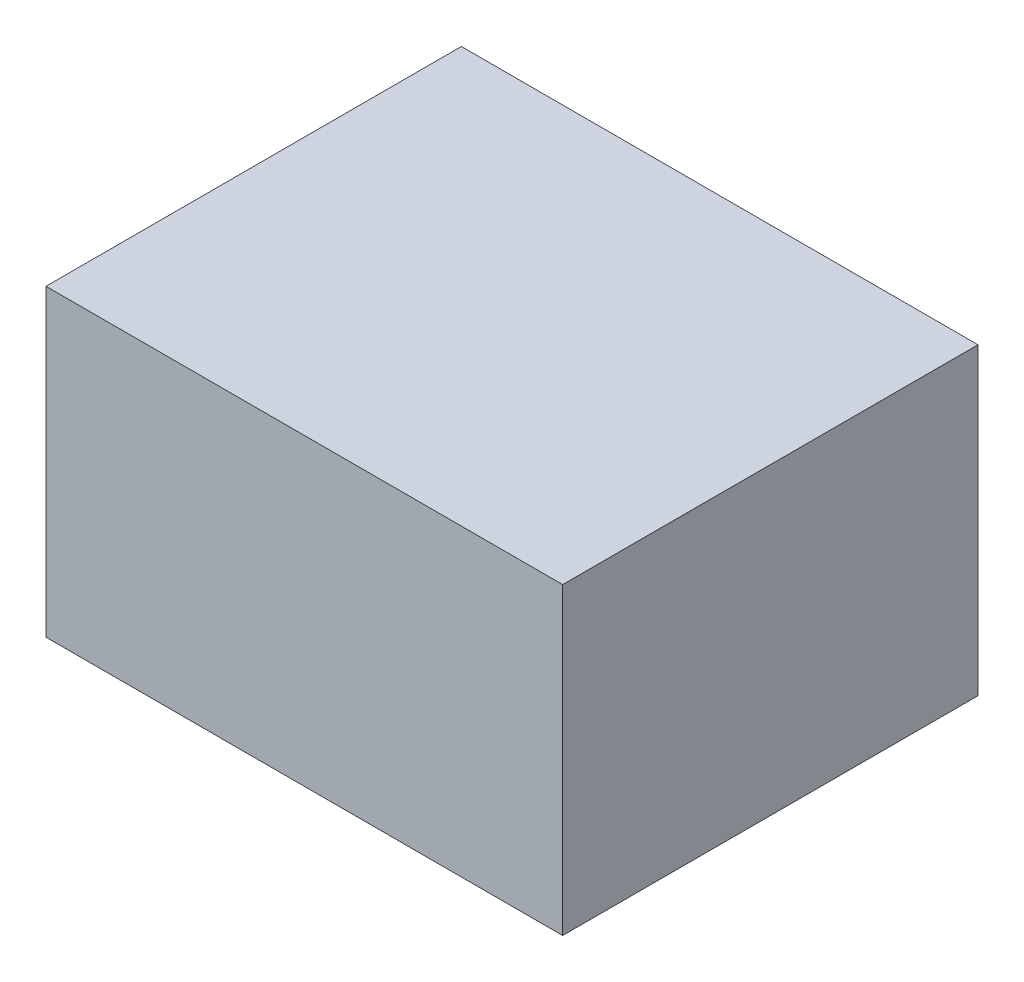
ISO-10303-21;
HEADER;
FILE_DESCRIPTION(('STEP AP214'),'2;1');
FILE_NAME('part.step','',(''),(''),'','','');
FILE_SCHEMA(('AUTOMOTIVE_DESIGN { 1 0 10303 214 1 1 1 1 }'));
ENDSEC;
DATA;
#1=APPLICATION_CONTEXT('core data for automotive mechanical design processes');
#2=APPLICATION_PROTOCOL_DEFINITION('international standard','automotive_design',2000,#1);
#3=PRODUCT_CONTEXT('',#1,'mechanical');
#4=PRODUCT('Part','Part','',(#3));
#5=PRODUCT_RELATED_PRODUCT_CATEGORY('part','',(#4));
#6=PRODUCT_DEFINITION_FORMATION('','',#4);
#7=PRODUCT_DEFINITION_CONTEXT('part definition',#1,'design');
#8=PRODUCT_DEFINITION('design','',#6,#7);
#9=PRODUCT_DEFINITION_SHAPE('','',#8);
#10=(LENGTH_UNIT() NAMED_UNIT(*) SI_UNIT(.MILLI.,.METRE.));
#11=(NAMED_UNIT(*) PLANE_ANGLE_UNIT() SI_UNIT($,.RADIAN.));
#12=(NAMED_UNIT(*) SI_UNIT($,.STERADIAN.) SOLID_ANGLE_UNIT());
#13=UNCERTAINTY_MEASURE_WITH_UNIT(LENGTH_MEASURE(1.E-05),#10,'distance_accuracy_value','');
#14=(GEOMETRIC_REPRESENTATION_CONTEXT(3) GLOBAL_UNCERTAINTY_ASSIGNED_CONTEXT((#13)) GLOBAL_UNIT_ASSIGNED_CONTEXT((#10,
#11,#12)) REPRESENTATION_CONTEXT('',''));
#15=CARTESIAN_POINT('',(0.,0.,0.));
#16=DIRECTION('',(0.,0.,1.));
#17=DIRECTION('',(1.,0.,0.));
#18=AXIS2_PLACEMENT_3D('',#15,#16,#17);
#19=CARTESIAN_POINT('',(0.,0.,0.));
#20=DIRECTION('',(0.,1.,0.));
#21=DIRECTION('',(0.,0.,1.));
#22=AXIS2_PLACEMENT_3D('',#19,#20,#21);
#23=PLANE('',#22);
#24=DIRECTION('',(0.,0.,-1.));
#25=VECTOR('',#24,1.);
#26=CARTESIAN_POINT('',(102.,0.,-81.9999999999999));
#27=LINE('',#26,#25);
#28=CARTESIAN_POINT('',(102.,0.,82.));
#29=VERTEX_POINT('',#28);
#30=CARTESIAN_POINT('',(102.,0.,-81.9999999999999));
#31=VERTEX_POINT('',#30);
#32=EDGE_CURVE('E135',#29,#31,#27,.T.);
#33=ORIENTED_EDGE('',*,*,#32,.F.);
#34=DIRECTION('',(1.,0.,0.));
#35=VECTOR('',#34,1.);
#36=CARTESIAN_POINT('',(-102.,0.,82.));
#37=LINE('',#36,#35);
#38=CARTESIAN_POINT('',(-102.,0.,82.));
#39=VERTEX_POINT('',#38);
#40=EDGE_CURVE('E86',#39,#29,#37,.T.);
#41=ORIENTED_EDGE('',*,*,#40,.F.);
#42=DIRECTION('',(0.,0.,1.));
#43=VECTOR('',#42,1.);
#44=CARTESIAN_POINT('',(-102.,0.,-81.9999999999999));
#45=LINE('',#44,#43);
#46=CARTESIAN_POINT('',(-102.,0.,-81.9999999999999));
#47=VERTEX_POINT('',#46);
#48=EDGE_CURVE('E153',#47,#39,#45,.T.);
#49=ORIENTED_EDGE('',*,*,#48,.F.);
#50=DIRECTION('',(-1.,0.,0.));
#51=VECTOR('',#50,1.);
#52=CARTESIAN_POINT('',(-102.,0.,-81.9999999999999));
#53=LINE('',#52,#51);
#54=EDGE_CURVE('E139',#31,#47,#53,.T.);
#55=ORIENTED_EDGE('',*,*,#54,.F.);
#56=EDGE_LOOP('',(#33,#41,#49,#55));
#57=FACE_BOUND('',#56,.T.);
#58=DIRECTION('',(0.,0.,-1.));
#59=VECTOR('',#58,1.);
#60=CARTESIAN_POINT('',(100.,0.,-80.));
#61=LINE('',#60,#59);
#62=CARTESIAN_POINT('',(100.,0.,80.));
#63=VERTEX_POINT('',#62);
#64=CARTESIAN_POINT('',(100.,0.,-80.));
#65=VERTEX_POINT('',#64);
#66=EDGE_CURVE('E56',#63,#65,#61,.T.);
#67=ORIENTED_EDGE('',*,*,#66,.T.);
#68=DIRECTION('',(-1.,0.,0.));
#69=VECTOR('',#68,1.);
#70=CARTESIAN_POINT('',(-100.,0.,-80.));
#71=LINE('',#70,#69);
#72=CARTESIAN_POINT('',(-100.,0.,-80.));
#73=VERTEX_POINT('',#72);
#74=EDGE_CURVE('E134',#65,#73,#71,.T.);
#75=ORIENTED_EDGE('',*,*,#74,.T.);
#76=DIRECTION('',(0.,0.,1.));
#77=VECTOR('',#76,1.);
#78=CARTESIAN_POINT('',(-100.,0.,-80.));
#79=LINE('',#78,#77);
#80=CARTESIAN_POINT('',(-100.,0.,80.));
#81=VERTEX_POINT('',#80);
#82=EDGE_CURVE('E267',#73,#81,#79,.T.);
#83=ORIENTED_EDGE('',*,*,#82,.T.);
#84=DIRECTION('',(1.,0.,0.));
#85=VECTOR('',#84,1.);
#86=CARTESIAN_POINT('',(-100.,0.,80.));
#87=LINE('',#86,#85);
#88=EDGE_CURVE('E130',#81,#63,#87,.T.);
#89=ORIENTED_EDGE('',*,*,#88,.T.);
#90=EDGE_LOOP('',(#67,#75,#83,#89));
#91=FACE_BOUND('',#90,.T.);
#92=ADVANCED_FACE('F41',(#57,#91),#23,.F.);
#93=CARTESIAN_POINT('',(102.,120.,-81.9999999999999));
#94=DIRECTION('',(-1.,0.,0.));
#95=DIRECTION('',(0.,0.,1.));
#96=AXIS2_PLACEMENT_3D('',#93,#94,#95);
#97=PLANE('',#96);
#98=ORIENTED_EDGE('',*,*,#32,.T.);
#99=DIRECTION('',(0.,-1.,0.));
#100=VECTOR('',#99,1.);
#101=CARTESIAN_POINT('',(102.,120.,-81.9999999999999));
#102=LINE('',#101,#100);
#103=CARTESIAN_POINT('',(102.,120.,-81.9999999999999));
#104=VERTEX_POINT('',#103);
#105=EDGE_CURVE('E11',#104,#31,#102,.T.);
#106=ORIENTED_EDGE('',*,*,#105,.F.);
#107=DIRECTION('',(0.,0.,-1.));
#108=VECTOR('',#107,1.);
#109=CARTESIAN_POINT('',(102.,120.,-81.9999999999999));
#110=LINE('',#109,#108);
#111=CARTESIAN_POINT('',(102.,120.,82.));
#112=VERTEX_POINT('',#111);
#113=EDGE_CURVE('E145',#112,#104,#110,.T.);
#114=ORIENTED_EDGE('',*,*,#113,.F.);
#115=DIRECTION('',(0.,-1.,0.));
#116=VECTOR('',#115,1.);
#117=CARTESIAN_POINT('',(102.,120.,82.));
#118=LINE('',#117,#116);
#119=EDGE_CURVE('E150',#112,#29,#118,.T.);
#120=ORIENTED_EDGE('',*,*,#119,.T.);
#121=EDGE_LOOP('',(#98,#106,#114,#120));
#122=FACE_BOUND('',#121,.T.);
#123=ADVANCED_FACE('F43',(#122),#97,.F.);
#124=CARTESIAN_POINT('',(-102.,120.,-81.9999999999999));
#125=DIRECTION('',(0.,0.,1.));
#126=DIRECTION('',(1.,0.,0.));
#127=AXIS2_PLACEMENT_3D('',#124,#125,#126);
#128=PLANE('',#127);
#129=ORIENTED_EDGE('',*,*,#54,.T.);
#130=DIRECTION('',(0.,-1.,0.));
#131=VECTOR('',#130,1.);
#132=CARTESIAN_POINT('',(-102.,120.,-81.9999999999999));
#133=LINE('',#132,#131);
#134=CARTESIAN_POINT('',(-102.,120.,-81.9999999999999));
#135=VERTEX_POINT('',#134);
#136=EDGE_CURVE('E49',#135,#47,#133,.T.);
#137=ORIENTED_EDGE('',*,*,#136,.F.);
#138=DIRECTION('',(-1.,0.,0.));
#139=VECTOR('',#138,1.);
#140=CARTESIAN_POINT('',(-102.,120.,-81.9999999999999));
#141=LINE('',#140,#139);
#142=EDGE_CURVE('E93',#104,#135,#141,.T.);
#143=ORIENTED_EDGE('',*,*,#142,.F.);
#144=ORIENTED_EDGE('',*,*,#105,.T.);
#145=EDGE_LOOP('',(#129,#137,#143,#144));
#146=FACE_BOUND('',#145,.T.);
#147=ADVANCED_FACE('F179',(#146),#128,.F.);
#148=CARTESIAN_POINT('',(-102.,120.,-81.9999999999999));
#149=DIRECTION('',(1.,0.,0.));
#150=DIRECTION('',(0.,0.,-1.));
#151=AXIS2_PLACEMENT_3D('',#148,#149,#150);
#152=PLANE('',#151);
#153=ORIENTED_EDGE('',*,*,#48,.T.);
#154=DIRECTION('',(0.,-1.,0.));
#155=VECTOR('',#154,1.);
#156=CARTESIAN_POINT('',(-102.,120.,82.));
#157=LINE('',#156,#155);
#158=CARTESIAN_POINT('',(-102.,120.,82.));
#159=VERTEX_POINT('',#158);
#160=EDGE_CURVE('E157',#159,#39,#157,.T.);
#161=ORIENTED_EDGE('',*,*,#160,.F.);
#162=DIRECTION('',(0.,0.,1.));
#163=VECTOR('',#162,1.);
#164=CARTESIAN_POINT('',(-102.,120.,-81.9999999999999));
#165=LINE('',#164,#163);
#166=EDGE_CURVE('E148',#135,#159,#165,.T.);
#167=ORIENTED_EDGE('',*,*,#166,.F.);
#168=ORIENTED_EDGE('',*,*,#136,.T.);
#169=EDGE_LOOP('',(#153,#161,#167,#168));
#170=FACE_BOUND('',#169,.T.);
#171=ADVANCED_FACE('F162',(#170),#152,.F.);
#172=CARTESIAN_POINT('',(-102.,120.,82.));
#173=DIRECTION('',(0.,0.,-1.));
#174=DIRECTION('',(-1.,0.,0.));
#175=AXIS2_PLACEMENT_3D('',#172,#173,#174);
#176=PLANE('',#175);
#177=ORIENTED_EDGE('',*,*,#40,.T.);
#178=ORIENTED_EDGE('',*,*,#119,.F.);
#179=DIRECTION('',(1.,0.,0.));
#180=VECTOR('',#179,1.);
#181=CARTESIAN_POINT('',(-102.,120.,82.));
#182=LINE('',#181,#180);
#183=EDGE_CURVE('E65',#159,#112,#182,.T.);
#184=ORIENTED_EDGE('',*,*,#183,.F.);
#185=ORIENTED_EDGE('',*,*,#160,.T.);
#186=EDGE_LOOP('',(#177,#178,#184,#185));
#187=FACE_BOUND('',#186,.T.);
#188=ADVANCED_FACE('F170',(#187),#176,.F.);
#189=CARTESIAN_POINT('',(0.,120.,0.));
#190=DIRECTION('',(0.,1.,0.));
#191=DIRECTION('',(0.,0.,1.));
#192=AXIS2_PLACEMENT_3D('',#189,#190,#191);
#193=PLANE('',#192);
#194=ORIENTED_EDGE('',*,*,#113,.T.);
#195=ORIENTED_EDGE('',*,*,#142,.T.);
#196=ORIENTED_EDGE('',*,*,#166,.T.);
#197=ORIENTED_EDGE('',*,*,#183,.T.);
#198=EDGE_LOOP('',(#194,#195,#196,#197));
#199=FACE_BOUND('',#198,.T.);
#200=ADVANCED_FACE('F172',(#199),#193,.T.);
#201=CARTESIAN_POINT('',(100.,116.,-80.));
#202=DIRECTION('',(-1.,0.,0.));
#203=DIRECTION('',(0.,0.,1.));
#204=AXIS2_PLACEMENT_3D('',#201,#202,#203);
#205=PLANE('',#204);
#206=ORIENTED_EDGE('',*,*,#66,.F.);
#207=DIRECTION('',(0.,-1.,0.));
#208=VECTOR('',#207,1.);
#209=CARTESIAN_POINT('',(100.,116.,80.));
#210=LINE('',#209,#208);
#211=CARTESIAN_POINT('',(100.,116.,80.));
#212=VERTEX_POINT('',#211);
#213=EDGE_CURVE('E129',#212,#63,#210,.T.);
#214=ORIENTED_EDGE('',*,*,#213,.F.);
#215=DIRECTION('',(0.,0.,-1.));
#216=VECTOR('',#215,1.);
#217=CARTESIAN_POINT('',(100.,116.,-80.));
#218=LINE('',#217,#216);
#219=CARTESIAN_POINT('',(100.,116.,-80.));
#220=VERTEX_POINT('',#219);
#221=EDGE_CURVE('E121',#212,#220,#218,.T.);
#222=ORIENTED_EDGE('',*,*,#221,.T.);
#223=DIRECTION('',(0.,-1.,0.));
#224=VECTOR('',#223,1.);
#225=CARTESIAN_POINT('',(100.,116.,-80.));
#226=LINE('',#225,#224);
#227=EDGE_CURVE('E128',#220,#65,#226,.T.);
#228=ORIENTED_EDGE('',*,*,#227,.T.);
#229=EDGE_LOOP('',(#206,#214,#222,#228));
#230=FACE_BOUND('',#229,.T.);
#231=ADVANCED_FACE('F127',(#230),#205,.T.);
#232=CARTESIAN_POINT('',(-100.,116.,-80.));
#233=DIRECTION('',(0.,0.,1.));
#234=DIRECTION('',(1.,0.,0.));
#235=AXIS2_PLACEMENT_3D('',#232,#233,#234);
#236=PLANE('',#235);
#237=ORIENTED_EDGE('',*,*,#74,.F.);
#238=ORIENTED_EDGE('',*,*,#227,.F.);
#239=DIRECTION('',(-1.,0.,0.));
#240=VECTOR('',#239,1.);
#241=CARTESIAN_POINT('',(-100.,116.,-80.));
#242=LINE('',#241,#240);
#243=CARTESIAN_POINT('',(-100.,116.,-80.));
#244=VERTEX_POINT('',#243);
#245=EDGE_CURVE('E117',#220,#244,#242,.T.);
#246=ORIENTED_EDGE('',*,*,#245,.T.);
#247=DIRECTION('',(0.,-1.,0.));
#248=VECTOR('',#247,1.);
#249=CARTESIAN_POINT('',(-100.,116.,-80.));
#250=LINE('',#249,#248);
#251=EDGE_CURVE('E136',#244,#73,#250,.T.);
#252=ORIENTED_EDGE('',*,*,#251,.T.);
#253=EDGE_LOOP('',(#237,#238,#246,#252));
#254=FACE_BOUND('',#253,.T.);
#255=ADVANCED_FACE('F132',(#254),#236,.T.);
#256=CARTESIAN_POINT('',(-100.,116.,-80.));
#257=DIRECTION('',(1.,0.,0.));
#258=DIRECTION('',(0.,0.,-1.));
#259=AXIS2_PLACEMENT_3D('',#256,#257,#258);
#260=PLANE('',#259);
#261=ORIENTED_EDGE('',*,*,#82,.F.);
#262=ORIENTED_EDGE('',*,*,#251,.F.);
#263=DIRECTION('',(0.,0.,1.));
#264=VECTOR('',#263,1.);
#265=CARTESIAN_POINT('',(-100.,116.,-80.));
#266=LINE('',#265,#264);
#267=CARTESIAN_POINT('',(-100.,116.,80.));
#268=VERTEX_POINT('',#267);
#269=EDGE_CURVE('E122',#244,#268,#266,.T.);
#270=ORIENTED_EDGE('',*,*,#269,.T.);
#271=DIRECTION('',(0.,-1.,0.));
#272=VECTOR('',#271,1.);
#273=CARTESIAN_POINT('',(-100.,116.,80.));
#274=LINE('',#273,#272);
#275=EDGE_CURVE('E141',#268,#81,#274,.T.);
#276=ORIENTED_EDGE('',*,*,#275,.T.);
#277=EDGE_LOOP('',(#261,#262,#270,#276));
#278=FACE_BOUND('',#277,.T.);
#279=ADVANCED_FACE('F191',(#278),#260,.T.);
#280=CARTESIAN_POINT('',(-100.,116.,80.));
#281=DIRECTION('',(0.,0.,-1.));
#282=DIRECTION('',(-1.,0.,0.));
#283=AXIS2_PLACEMENT_3D('',#280,#281,#282);
#284=PLANE('',#283);
#285=ORIENTED_EDGE('',*,*,#88,.F.);
#286=ORIENTED_EDGE('',*,*,#275,.F.);
#287=DIRECTION('',(1.,0.,0.));
#288=VECTOR('',#287,1.);
#289=CARTESIAN_POINT('',(-100.,116.,80.));
#290=LINE('',#289,#288);
#291=EDGE_CURVE('E274',#268,#212,#290,.T.);
#292=ORIENTED_EDGE('',*,*,#291,.T.);
#293=ORIENTED_EDGE('',*,*,#213,.T.);
#294=EDGE_LOOP('',(#285,#286,#292,#293));
#295=FACE_BOUND('',#294,.T.);
#296=ADVANCED_FACE('F194',(#295),#284,.T.);
#297=CARTESIAN_POINT('',(0.,116.,0.));
#298=DIRECTION('',(0.,1.,0.));
#299=DIRECTION('',(0.,0.,1.));
#300=AXIS2_PLACEMENT_3D('',#297,#298,#299);
#301=PLANE('',#300);
#302=ORIENTED_EDGE('',*,*,#221,.F.);
#303=ORIENTED_EDGE('',*,*,#291,.F.);
#304=ORIENTED_EDGE('',*,*,#269,.F.);
#305=ORIENTED_EDGE('',*,*,#245,.F.);
#306=EDGE_LOOP('',(#302,#303,#304,#305));
#307=FACE_BOUND('',#306,.T.);
#308=ADVANCED_FACE('F119',(#307),#301,.F.);
#309=CLOSED_SHELL('',(#92,#123,#147,#171,#188,#200,#231,#255,#279,#296,#308));
#310=MANIFOLD_SOLID_BREP('B2',#309);
#311=ADVANCED_BREP_SHAPE_REPRESENTATION('',(#18,#310),#14);
#312=SHAPE_DEFINITION_REPRESENTATION(#9,#311);
ENDSEC;
END-ISO-10303-21;
